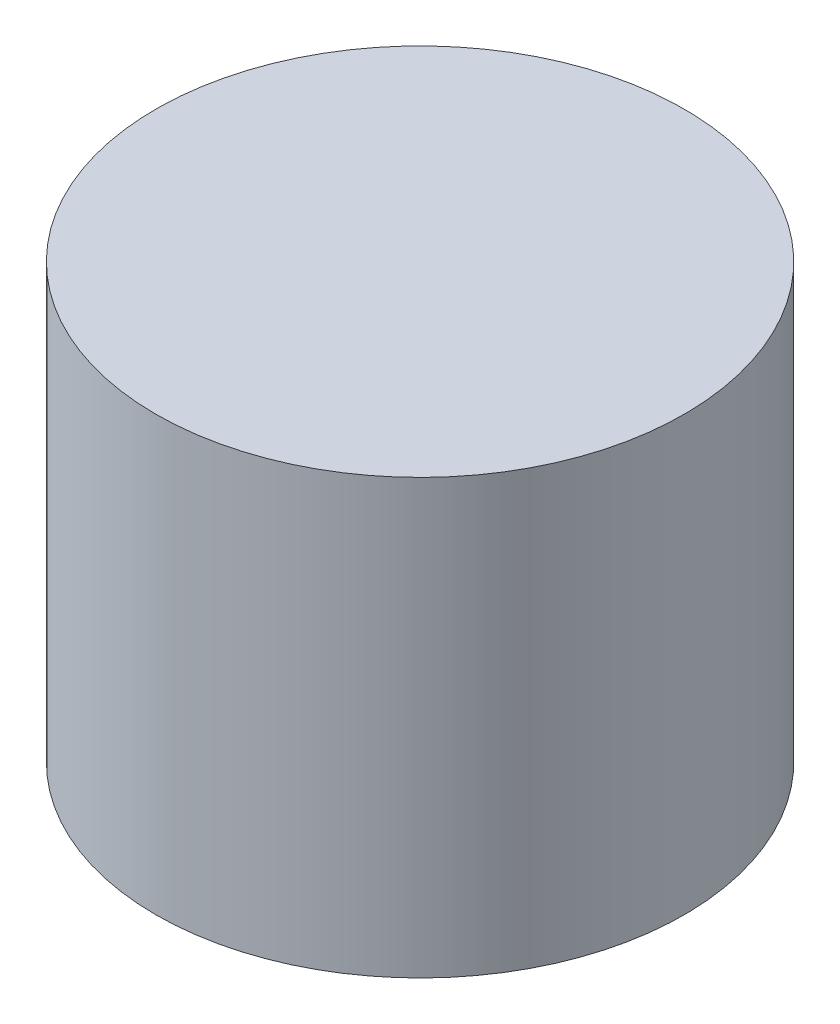
ISO-10303-21;
HEADER;
FILE_DESCRIPTION(('STEP AP214'),'2;1');
FILE_NAME('part.step','',(''),(''),'','','');
FILE_SCHEMA(('AUTOMOTIVE_DESIGN { 1 0 10303 214 1 1 1 1 }'));
ENDSEC;
DATA;
#1=APPLICATION_CONTEXT('core data for automotive mechanical design processes');
#2=APPLICATION_PROTOCOL_DEFINITION('international standard','automotive_design',2000,#1);
#3=PRODUCT_CONTEXT('',#1,'mechanical');
#4=PRODUCT('Part','Part','',(#3));
#5=PRODUCT_RELATED_PRODUCT_CATEGORY('part','',(#4));
#6=PRODUCT_DEFINITION_FORMATION('','',#4);
#7=PRODUCT_DEFINITION_CONTEXT('part definition',#1,'design');
#8=PRODUCT_DEFINITION('design','',#6,#7);
#9=PRODUCT_DEFINITION_SHAPE('','',#8);
#10=(LENGTH_UNIT() NAMED_UNIT(*) SI_UNIT(.MILLI.,.METRE.));
#11=(NAMED_UNIT(*) PLANE_ANGLE_UNIT() SI_UNIT($,.RADIAN.));
#12=(NAMED_UNIT(*) SI_UNIT($,.STERADIAN.) SOLID_ANGLE_UNIT());
#13=UNCERTAINTY_MEASURE_WITH_UNIT(LENGTH_MEASURE(1.E-05),#10,'distance_accuracy_value','');
#14=(GEOMETRIC_REPRESENTATION_CONTEXT(3) GLOBAL_UNCERTAINTY_ASSIGNED_CONTEXT((#13)) GLOBAL_UNIT_ASSIGNED_CONTEXT((#10,
#11,#12)) REPRESENTATION_CONTEXT('',''));
#15=CARTESIAN_POINT('',(0.,0.,0.));
#16=DIRECTION('',(0.,0.,1.));
#17=DIRECTION('',(1.,0.,0.));
#18=AXIS2_PLACEMENT_3D('',#15,#16,#17);
#19=CARTESIAN_POINT('',(0.,26.25,0.));
#20=DIRECTION('',(0.,-1.,0.));
#21=DIRECTION('',(0.,0.,-1.));
#22=AXIS2_PLACEMENT_3D('',#19,#20,#21);
#23=CYLINDRICAL_SURFACE('',#22,32.);
#24=CARTESIAN_POINT('',(0.,26.25,0.));
#25=DIRECTION('',(0.,1.,0.));
#26=DIRECTION('',(0.,0.,1.));
#27=AXIS2_PLACEMENT_3D('',#24,#25,#26);
#28=CIRCLE('',#27,32.);
#29=CARTESIAN_POINT('',(0.,26.25,32.));
#30=VERTEX_POINT('',#29);
#31=EDGE_CURVE('E10',#30,#30,#28,.T.);
#32=ORIENTED_EDGE('',*,*,#31,.F.);
#33=EDGE_LOOP('',(#32));
#34=FACE_BOUND('',#33,.T.);
#35=CARTESIAN_POINT('',(0.,-26.25,0.));
#36=DIRECTION('',(0.,1.,0.));
#37=DIRECTION('',(0.,0.,1.));
#38=AXIS2_PLACEMENT_3D('',#35,#36,#37);
#39=CIRCLE('',#38,32.);
#40=CARTESIAN_POINT('',(0.,-26.25,32.));
#41=VERTEX_POINT('',#40);
#42=EDGE_CURVE('E34',#41,#41,#39,.T.);
#43=ORIENTED_EDGE('',*,*,#42,.T.);
#44=EDGE_LOOP('',(#43));
#45=FACE_BOUND('',#44,.T.);
#46=ADVANCED_FACE('F31',(#34,#45),#23,.T.);
#47=CARTESIAN_POINT('',(0.,26.25,0.));
#48=DIRECTION('',(0.,1.,0.));
#49=DIRECTION('',(0.,0.,1.));
#50=AXIS2_PLACEMENT_3D('',#47,#48,#49);
#51=PLANE('',#50);
#52=ORIENTED_EDGE('',*,*,#31,.T.);
#53=EDGE_LOOP('',(#52));
#54=FACE_BOUND('',#53,.T.);
#55=ADVANCED_FACE('F46',(#54),#51,.T.);
#56=CARTESIAN_POINT('',(0.,-26.25,0.));
#57=DIRECTION('',(0.,1.,0.));
#58=DIRECTION('',(0.,0.,1.));
#59=AXIS2_PLACEMENT_3D('',#56,#57,#58);
#60=PLANE('',#59);
#61=ORIENTED_EDGE('',*,*,#42,.F.);
#62=EDGE_LOOP('',(#61));
#63=FACE_BOUND('',#62,.T.);
#64=ADVANCED_FACE('F44',(#63),#60,.F.);
#65=CLOSED_SHELL('',(#46,#55,#64));
#66=MANIFOLD_SOLID_BREP('B2',#65);
#67=ADVANCED_BREP_SHAPE_REPRESENTATION('',(#18,#66),#14);
#68=SHAPE_DEFINITION_REPRESENTATION(#9,#67);
ENDSEC;
END-ISO-10303-21;
